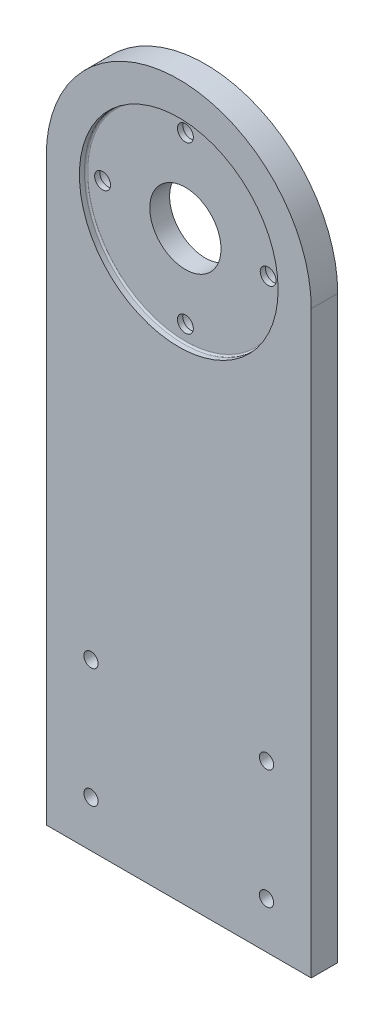
ISO-10303-21;
HEADER;
FILE_DESCRIPTION(('STEP AP214'),'2;1');
FILE_NAME('part.step','',(''),(''),'','','');
FILE_SCHEMA(('AUTOMOTIVE_DESIGN { 1 0 10303 214 1 1 1 1 }'));
ENDSEC;
DATA;
#1=APPLICATION_CONTEXT('core data for automotive mechanical design processes');
#2=APPLICATION_PROTOCOL_DEFINITION('international standard','automotive_design',2000,#1);
#3=PRODUCT_CONTEXT('',#1,'mechanical');
#4=PRODUCT('Part','Part','',(#3));
#5=PRODUCT_RELATED_PRODUCT_CATEGORY('part','',(#4));
#6=PRODUCT_DEFINITION_FORMATION('','',#4);
#7=PRODUCT_DEFINITION_CONTEXT('part definition',#1,'design');
#8=PRODUCT_DEFINITION('design','',#6,#7);
#9=PRODUCT_DEFINITION_SHAPE('','',#8);
#10=(LENGTH_UNIT() NAMED_UNIT(*) SI_UNIT(.MILLI.,.METRE.));
#11=(NAMED_UNIT(*) PLANE_ANGLE_UNIT() SI_UNIT($,.RADIAN.));
#12=(NAMED_UNIT(*) SI_UNIT($,.STERADIAN.) SOLID_ANGLE_UNIT());
#13=UNCERTAINTY_MEASURE_WITH_UNIT(LENGTH_MEASURE(1.E-05),#10,'distance_accuracy_value','');
#14=(GEOMETRIC_REPRESENTATION_CONTEXT(3) GLOBAL_UNCERTAINTY_ASSIGNED_CONTEXT((#13)) GLOBAL_UNIT_ASSIGNED_CONTEXT((#10,
#11,#12)) REPRESENTATION_CONTEXT('',''));
#15=CARTESIAN_POINT('',(0.,0.,0.));
#16=DIRECTION('',(0.,0.,1.));
#17=DIRECTION('',(1.,0.,0.));
#18=AXIS2_PLACEMENT_3D('',#15,#16,#17);
#19=CARTESIAN_POINT('',(-40.,175.,8.));
#20=DIRECTION('',(0.,0.,1.));
#21=DIRECTION('',(1.,0.,0.));
#22=AXIS2_PLACEMENT_3D('',#19,#20,#21);
#23=CYLINDRICAL_SURFACE('',#22,10.75);
#24=CARTESIAN_POINT('',(-40.,175.,0.));
#25=DIRECTION('',(0.,0.,1.));
#26=DIRECTION('',(1.,0.,0.));
#27=AXIS2_PLACEMENT_3D('',#24,#25,#26);
#28=CIRCLE('',#27,10.75);
#29=CARTESIAN_POINT('',(-29.25,175.,0.));
#30=VERTEX_POINT('',#29);
#31=EDGE_CURVE('E209',#30,#30,#28,.T.);
#32=ORIENTED_EDGE('',*,*,#31,.F.);
#33=EDGE_LOOP('',(#32));
#34=FACE_BOUND('',#33,.T.);
#35=CARTESIAN_POINT('',(-40.,175.,6.));
#36=DIRECTION('',(0.,0.,1.));
#37=DIRECTION('',(1.,0.,0.));
#38=AXIS2_PLACEMENT_3D('',#35,#36,#37);
#39=CIRCLE('',#38,10.75);
#40=CARTESIAN_POINT('',(-29.25,175.,6.));
#41=VERTEX_POINT('',#40);
#42=EDGE_CURVE('E248',#41,#41,#39,.F.);
#43=ORIENTED_EDGE('',*,*,#42,.F.);
#44=EDGE_LOOP('',(#43));
#45=FACE_BOUND('',#44,.T.);
#46=ADVANCED_FACE('F36',(#34,#45),#23,.F.);
#47=CARTESIAN_POINT('',(-65.0002210524578,175.000221056367,0.));
#48=DIRECTION('',(0.,0.,-1.));
#49=DIRECTION('',(-1.,0.,0.));
#50=AXIS2_PLACEMENT_3D('',#47,#48,#49);
#51=CYLINDRICAL_SURFACE('',#50,2.4);
#52=CARTESIAN_POINT('',(-65.0002210524578,175.000221056367,4.4));
#53=DIRECTION('',(0.,0.,-1.));
#54=DIRECTION('',(-1.,0.,0.));
#55=AXIS2_PLACEMENT_3D('',#52,#53,#54);
#56=CIRCLE('',#55,2.4);
#57=CARTESIAN_POINT('',(-67.4002210524578,175.000221056367,4.4));
#58=VERTEX_POINT('',#57);
#59=EDGE_CURVE('E212',#58,#58,#56,.T.);
#60=ORIENTED_EDGE('',*,*,#59,.T.);
#61=EDGE_LOOP('',(#60));
#62=FACE_BOUND('',#61,.T.);
#63=CARTESIAN_POINT('',(-65.0002210524578,175.000221056367,6.));
#64=DIRECTION('',(0.,0.,1.));
#65=DIRECTION('',(1.,0.,0.));
#66=AXIS2_PLACEMENT_3D('',#63,#64,#65);
#67=CIRCLE('',#66,2.4);
#68=CARTESIAN_POINT('',(-62.6002210524578,175.000221056367,6.));
#69=VERTEX_POINT('',#68);
#70=EDGE_CURVE('E251',#69,#69,#67,.F.);
#71=ORIENTED_EDGE('',*,*,#70,.F.);
#72=EDGE_LOOP('',(#71));
#73=FACE_BOUND('',#72,.T.);
#74=ADVANCED_FACE('F134',(#62,#73),#51,.F.);
#75=CARTESIAN_POINT('',(-40.0004421088247,150.000000003909,0.));
#76=DIRECTION('',(0.,0.,-1.));
#77=DIRECTION('',(-1.,0.,0.));
#78=AXIS2_PLACEMENT_3D('',#75,#76,#77);
#79=CYLINDRICAL_SURFACE('',#78,2.4);
#80=CARTESIAN_POINT('',(-40.0004421088247,150.000000003909,4.4));
#81=DIRECTION('',(0.,0.,-1.));
#82=DIRECTION('',(-1.,0.,0.));
#83=AXIS2_PLACEMENT_3D('',#80,#81,#82);
#84=CIRCLE('',#83,2.4);
#85=CARTESIAN_POINT('',(-42.4004421088247,150.000000003909,4.4));
#86=VERTEX_POINT('',#85);
#87=EDGE_CURVE('E221',#86,#86,#84,.T.);
#88=ORIENTED_EDGE('',*,*,#87,.T.);
#89=EDGE_LOOP('',(#88));
#90=FACE_BOUND('',#89,.T.);
#91=CARTESIAN_POINT('',(-40.0004421088247,150.000000003909,6.));
#92=DIRECTION('',(0.,0.,1.));
#93=DIRECTION('',(1.,0.,0.));
#94=AXIS2_PLACEMENT_3D('',#91,#92,#93);
#95=CIRCLE('',#94,2.4);
#96=CARTESIAN_POINT('',(-37.6004421088247,150.000000003909,6.));
#97=VERTEX_POINT('',#96);
#98=EDGE_CURVE('E254',#97,#97,#95,.F.);
#99=ORIENTED_EDGE('',*,*,#98,.F.);
#100=EDGE_LOOP('',(#99));
#101=FACE_BOUND('',#100,.T.);
#102=ADVANCED_FACE('F140',(#90,#101),#79,.F.);
#103=CARTESIAN_POINT('',(-15.000221056367,174.999778947542,0.));
#104=DIRECTION('',(0.,0.,-1.));
#105=DIRECTION('',(-1.,0.,0.));
#106=AXIS2_PLACEMENT_3D('',#103,#104,#105);
#107=CYLINDRICAL_SURFACE('',#106,2.4);
#108=CARTESIAN_POINT('',(-15.000221056367,174.999778947542,4.4));
#109=DIRECTION('',(0.,0.,-1.));
#110=DIRECTION('',(-1.,0.,0.));
#111=AXIS2_PLACEMENT_3D('',#108,#109,#110);
#112=CIRCLE('',#111,2.4);
#113=CARTESIAN_POINT('',(-17.400221056367,174.999778947542,4.4));
#114=VERTEX_POINT('',#113);
#115=EDGE_CURVE('E230',#114,#114,#112,.T.);
#116=ORIENTED_EDGE('',*,*,#115,.T.);
#117=EDGE_LOOP('',(#116));
#118=FACE_BOUND('',#117,.T.);
#119=CARTESIAN_POINT('',(-15.000221056367,174.999778947542,6.));
#120=DIRECTION('',(0.,0.,1.));
#121=DIRECTION('',(1.,0.,0.));
#122=AXIS2_PLACEMENT_3D('',#119,#120,#121);
#123=CIRCLE('',#122,2.4);
#124=CARTESIAN_POINT('',(-12.600221056367,174.999778947542,6.));
#125=VERTEX_POINT('',#124);
#126=EDGE_CURVE('E116',#125,#125,#123,.F.);
#127=ORIENTED_EDGE('',*,*,#126,.F.);
#128=EDGE_LOOP('',(#127));
#129=FACE_BOUND('',#128,.T.);
#130=ADVANCED_FACE('F278',(#118,#129),#107,.F.);
#131=CARTESIAN_POINT('',(-40.,200.,0.));
#132=DIRECTION('',(0.,0.,-1.));
#133=DIRECTION('',(-1.,0.,0.));
#134=AXIS2_PLACEMENT_3D('',#131,#132,#133);
#135=CYLINDRICAL_SURFACE('',#134,2.4);
#136=CARTESIAN_POINT('',(-40.,200.,4.4));
#137=DIRECTION('',(0.,0.,-1.));
#138=DIRECTION('',(-1.,0.,0.));
#139=AXIS2_PLACEMENT_3D('',#136,#137,#138);
#140=CIRCLE('',#139,2.4);
#141=CARTESIAN_POINT('',(-42.4,200.,4.4));
#142=VERTEX_POINT('',#141);
#143=EDGE_CURVE('E239',#142,#142,#140,.T.);
#144=ORIENTED_EDGE('',*,*,#143,.T.);
#145=EDGE_LOOP('',(#144));
#146=FACE_BOUND('',#145,.T.);
#147=CARTESIAN_POINT('',(-40.,200.,6.));
#148=DIRECTION('',(0.,0.,1.));
#149=DIRECTION('',(1.,0.,0.));
#150=AXIS2_PLACEMENT_3D('',#147,#148,#149);
#151=CIRCLE('',#150,2.4);
#152=CARTESIAN_POINT('',(-37.6,200.,6.));
#153=VERTEX_POINT('',#152);
#154=EDGE_CURVE('E114',#153,#153,#151,.F.);
#155=ORIENTED_EDGE('',*,*,#154,.F.);
#156=EDGE_LOOP('',(#155));
#157=FACE_BOUND('',#156,.T.);
#158=ADVANCED_FACE('F168',(#146,#157),#135,.F.);
#159=CARTESIAN_POINT('',(-40.,175.,8.));
#160=DIRECTION('',(0.,0.,1.));
#161=DIRECTION('',(1.,0.,0.));
#162=AXIS2_PLACEMENT_3D('',#159,#160,#161);
#163=PLANE('',#162);
#164=CARTESIAN_POINT('',(-40.,175.,8.));
#165=DIRECTION('',(0.,0.,1.));
#166=DIRECTION('',(1.,0.,0.));
#167=AXIS2_PLACEMENT_3D('',#164,#165,#166);
#168=CIRCLE('',#167,30.);
#169=CARTESIAN_POINT('',(-9.99999999999999,175.,8.));
#170=VERTEX_POINT('',#169);
#171=EDGE_CURVE('E117',#170,#170,#168,.T.);
#172=ORIENTED_EDGE('',*,*,#171,.F.);
#173=EDGE_LOOP('',(#172));
#174=FACE_BOUND('',#173,.T.);
#175=CARTESIAN_POINT('',(-66.5,14.,8.));
#176=DIRECTION('',(0.,0.,1.));
#177=DIRECTION('',(1.,0.,0.));
#178=AXIS2_PLACEMENT_3D('',#175,#176,#177);
#179=CIRCLE('',#178,2.15);
#180=CARTESIAN_POINT('',(-64.35,14.,8.));
#181=VERTEX_POINT('',#180);
#182=EDGE_CURVE('E206',#181,#181,#179,.T.);
#183=ORIENTED_EDGE('',*,*,#182,.F.);
#184=EDGE_LOOP('',(#183));
#185=FACE_BOUND('',#184,.T.);
#186=CARTESIAN_POINT('',(-13.5,14.,8.));
#187=DIRECTION('',(0.,0.,1.));
#188=DIRECTION('',(1.,0.,0.));
#189=AXIS2_PLACEMENT_3D('',#186,#187,#188);
#190=CIRCLE('',#189,2.15);
#191=CARTESIAN_POINT('',(-11.35,14.,8.));
#192=VERTEX_POINT('',#191);
#193=EDGE_CURVE('E200',#192,#192,#190,.T.);
#194=ORIENTED_EDGE('',*,*,#193,.F.);
#195=EDGE_LOOP('',(#194));
#196=FACE_BOUND('',#195,.T.);
#197=CARTESIAN_POINT('',(-13.5,50.,8.));
#198=DIRECTION('',(0.,0.,1.));
#199=DIRECTION('',(1.,0.,0.));
#200=AXIS2_PLACEMENT_3D('',#197,#198,#199);
#201=CIRCLE('',#200,2.15);
#202=CARTESIAN_POINT('',(-11.35,50.,8.));
#203=VERTEX_POINT('',#202);
#204=EDGE_CURVE('E194',#203,#203,#201,.T.);
#205=ORIENTED_EDGE('',*,*,#204,.F.);
#206=EDGE_LOOP('',(#205));
#207=FACE_BOUND('',#206,.T.);
#208=CARTESIAN_POINT('',(-66.5,50.,8.));
#209=DIRECTION('',(0.,0.,1.));
#210=DIRECTION('',(1.,0.,0.));
#211=AXIS2_PLACEMENT_3D('',#208,#209,#210);
#212=CIRCLE('',#211,2.15);
#213=CARTESIAN_POINT('',(-64.35,50.,8.));
#214=VERTEX_POINT('',#213);
#215=EDGE_CURVE('E188',#214,#214,#212,.T.);
#216=ORIENTED_EDGE('',*,*,#215,.F.);
#217=EDGE_LOOP('',(#216));
#218=FACE_BOUND('',#217,.T.);
#219=DIRECTION('',(0.,1.,0.));
#220=VECTOR('',#219,1.);
#221=CARTESIAN_POINT('',(0.,0.,8.));
#222=LINE('',#221,#220);
#223=CARTESIAN_POINT('',(0.,0.,8.));
#224=VERTEX_POINT('',#223);
#225=CARTESIAN_POINT('',(0.,175.,8.));
#226=VERTEX_POINT('',#225);
#227=EDGE_CURVE('E89',#224,#226,#222,.T.);
#228=ORIENTED_EDGE('',*,*,#227,.T.);
#229=CARTESIAN_POINT('',(-40.,175.,8.));
#230=DIRECTION('',(0.,0.,1.));
#231=DIRECTION('',(1.,0.,0.));
#232=AXIS2_PLACEMENT_3D('',#229,#230,#231);
#233=CIRCLE('',#232,40.);
#234=CARTESIAN_POINT('',(-80.,175.,8.));
#235=VERTEX_POINT('',#234);
#236=EDGE_CURVE('E84',#226,#235,#233,.T.);
#237=ORIENTED_EDGE('',*,*,#236,.T.);
#238=DIRECTION('',(0.,-1.,0.));
#239=VECTOR('',#238,1.);
#240=CARTESIAN_POINT('',(-80.,0.,8.));
#241=LINE('',#240,#239);
#242=CARTESIAN_POINT('',(-80.,0.,8.));
#243=VERTEX_POINT('',#242);
#244=EDGE_CURVE('E87',#235,#243,#241,.T.);
#245=ORIENTED_EDGE('',*,*,#244,.T.);
#246=DIRECTION('',(1.,0.,0.));
#247=VECTOR('',#246,1.);
#248=CARTESIAN_POINT('',(0.,0.,8.));
#249=LINE('',#248,#247);
#250=EDGE_CURVE('E53',#243,#224,#249,.T.);
#251=ORIENTED_EDGE('',*,*,#250,.T.);
#252=EDGE_LOOP('',(#228,#237,#245,#251));
#253=FACE_BOUND('',#252,.T.);
#254=ADVANCED_FACE('F85',(#174,#185,#196,#207,#218,#253),#163,.T.);
#255=CARTESIAN_POINT('',(-40.,175.,0.));
#256=DIRECTION('',(0.,0.,1.));
#257=DIRECTION('',(1.,0.,0.));
#258=AXIS2_PLACEMENT_3D('',#255,#256,#257);
#259=PLANE('',#258);
#260=CARTESIAN_POINT('',(-40.,200.,0.));
#261=DIRECTION('',(0.,0.,-1.));
#262=DIRECTION('',(-1.,0.,0.));
#263=AXIS2_PLACEMENT_3D('',#260,#261,#262);
#264=CIRCLE('',#263,4.);
#265=CARTESIAN_POINT('',(-44.,200.,0.));
#266=VERTEX_POINT('',#265);
#267=EDGE_CURVE('E245',#266,#266,#264,.T.);
#268=ORIENTED_EDGE('',*,*,#267,.F.);
#269=EDGE_LOOP('',(#268));
#270=FACE_BOUND('',#269,.T.);
#271=CARTESIAN_POINT('',(-15.000221056367,174.999778947542,0.));
#272=DIRECTION('',(0.,0.,-1.));
#273=DIRECTION('',(-1.,0.,0.));
#274=AXIS2_PLACEMENT_3D('',#271,#272,#273);
#275=CIRCLE('',#274,4.);
#276=CARTESIAN_POINT('',(-19.000221056367,174.999778947542,0.));
#277=VERTEX_POINT('',#276);
#278=EDGE_CURVE('E236',#277,#277,#275,.T.);
#279=ORIENTED_EDGE('',*,*,#278,.F.);
#280=EDGE_LOOP('',(#279));
#281=FACE_BOUND('',#280,.T.);
#282=CARTESIAN_POINT('',(-40.0004421088247,150.000000003909,0.));
#283=DIRECTION('',(0.,0.,-1.));
#284=DIRECTION('',(-1.,0.,0.));
#285=AXIS2_PLACEMENT_3D('',#282,#283,#284);
#286=CIRCLE('',#285,4.);
#287=CARTESIAN_POINT('',(-44.0004421088247,150.000000003909,0.));
#288=VERTEX_POINT('',#287);
#289=EDGE_CURVE('E227',#288,#288,#286,.T.);
#290=ORIENTED_EDGE('',*,*,#289,.F.);
#291=EDGE_LOOP('',(#290));
#292=FACE_BOUND('',#291,.T.);
#293=CARTESIAN_POINT('',(-65.0002210524578,175.000221056367,0.));
#294=DIRECTION('',(0.,0.,-1.));
#295=DIRECTION('',(-1.,0.,0.));
#296=AXIS2_PLACEMENT_3D('',#293,#294,#295);
#297=CIRCLE('',#296,4.);
#298=CARTESIAN_POINT('',(-69.0002210524578,175.000221056367,0.));
#299=VERTEX_POINT('',#298);
#300=EDGE_CURVE('E218',#299,#299,#297,.T.);
#301=ORIENTED_EDGE('',*,*,#300,.F.);
#302=EDGE_LOOP('',(#301));
#303=FACE_BOUND('',#302,.T.);
#304=ORIENTED_EDGE('',*,*,#31,.T.);
#305=EDGE_LOOP('',(#304));
#306=FACE_BOUND('',#305,.T.);
#307=CARTESIAN_POINT('',(-66.5,14.,0.));
#308=DIRECTION('',(0.,0.,1.));
#309=DIRECTION('',(1.,0.,0.));
#310=AXIS2_PLACEMENT_3D('',#307,#308,#309);
#311=CIRCLE('',#310,2.15);
#312=CARTESIAN_POINT('',(-64.35,14.,0.));
#313=VERTEX_POINT('',#312);
#314=EDGE_CURVE('E203',#313,#313,#311,.T.);
#315=ORIENTED_EDGE('',*,*,#314,.T.);
#316=EDGE_LOOP('',(#315));
#317=FACE_BOUND('',#316,.T.);
#318=CARTESIAN_POINT('',(-13.5,14.,0.));
#319=DIRECTION('',(0.,0.,1.));
#320=DIRECTION('',(1.,0.,0.));
#321=AXIS2_PLACEMENT_3D('',#318,#319,#320);
#322=CIRCLE('',#321,2.15);
#323=CARTESIAN_POINT('',(-11.35,14.,0.));
#324=VERTEX_POINT('',#323);
#325=EDGE_CURVE('E197',#324,#324,#322,.T.);
#326=ORIENTED_EDGE('',*,*,#325,.T.);
#327=EDGE_LOOP('',(#326));
#328=FACE_BOUND('',#327,.T.);
#329=CARTESIAN_POINT('',(-13.5,50.,0.));
#330=DIRECTION('',(0.,0.,1.));
#331=DIRECTION('',(1.,0.,0.));
#332=AXIS2_PLACEMENT_3D('',#329,#330,#331);
#333=CIRCLE('',#332,2.15);
#334=CARTESIAN_POINT('',(-11.35,50.,0.));
#335=VERTEX_POINT('',#334);
#336=EDGE_CURVE('E191',#335,#335,#333,.T.);
#337=ORIENTED_EDGE('',*,*,#336,.T.);
#338=EDGE_LOOP('',(#337));
#339=FACE_BOUND('',#338,.T.);
#340=CARTESIAN_POINT('',(-66.5,50.,0.));
#341=DIRECTION('',(0.,0.,1.));
#342=DIRECTION('',(1.,0.,0.));
#343=AXIS2_PLACEMENT_3D('',#340,#341,#342);
#344=CIRCLE('',#343,2.15);
#345=CARTESIAN_POINT('',(-64.35,50.,0.));
#346=VERTEX_POINT('',#345);
#347=EDGE_CURVE('E107',#346,#346,#344,.T.);
#348=ORIENTED_EDGE('',*,*,#347,.T.);
#349=EDGE_LOOP('',(#348));
#350=FACE_BOUND('',#349,.T.);
#351=DIRECTION('',(0.,1.,0.));
#352=VECTOR('',#351,1.);
#353=CARTESIAN_POINT('',(0.,0.,0.));
#354=LINE('',#353,#352);
#355=CARTESIAN_POINT('',(0.,0.,0.));
#356=VERTEX_POINT('',#355);
#357=CARTESIAN_POINT('',(0.,175.,0.));
#358=VERTEX_POINT('',#357);
#359=EDGE_CURVE('E104',#356,#358,#354,.T.);
#360=ORIENTED_EDGE('',*,*,#359,.F.);
#361=DIRECTION('',(1.,0.,0.));
#362=VECTOR('',#361,1.);
#363=CARTESIAN_POINT('',(0.,0.,0.));
#364=LINE('',#363,#362);
#365=CARTESIAN_POINT('',(-80.,0.,0.));
#366=VERTEX_POINT('',#365);
#367=EDGE_CURVE('E76',#366,#356,#364,.T.);
#368=ORIENTED_EDGE('',*,*,#367,.F.);
#369=DIRECTION('',(0.,-1.,0.));
#370=VECTOR('',#369,1.);
#371=CARTESIAN_POINT('',(-80.,0.,0.));
#372=LINE('',#371,#370);
#373=CARTESIAN_POINT('',(-80.,175.,0.));
#374=VERTEX_POINT('',#373);
#375=EDGE_CURVE('E70',#374,#366,#372,.T.);
#376=ORIENTED_EDGE('',*,*,#375,.F.);
#377=CARTESIAN_POINT('',(-40.,175.,0.));
#378=DIRECTION('',(0.,0.,1.));
#379=DIRECTION('',(1.,0.,0.));
#380=AXIS2_PLACEMENT_3D('',#377,#378,#379);
#381=CIRCLE('',#380,40.);
#382=EDGE_CURVE('E94',#358,#374,#381,.T.);
#383=ORIENTED_EDGE('',*,*,#382,.F.);
#384=EDGE_LOOP('',(#360,#368,#376,#383));
#385=FACE_BOUND('',#384,.T.);
#386=ADVANCED_FACE('F167',(#270,#281,#292,#303,#306,#317,#328,#339,#350,#385),#259,.F.);
#387=CARTESIAN_POINT('',(0.,0.,8.));
#388=DIRECTION('',(-1.,0.,0.));
#389=DIRECTION('',(0.,0.,1.));
#390=AXIS2_PLACEMENT_3D('',#387,#388,#389);
#391=PLANE('',#390);
#392=ORIENTED_EDGE('',*,*,#359,.T.);
#393=DIRECTION('',(0.,0.,-1.));
#394=VECTOR('',#393,1.);
#395=CARTESIAN_POINT('',(0.,175.,8.));
#396=LINE('',#395,#394);
#397=EDGE_CURVE('E95',#226,#358,#396,.T.);
#398=ORIENTED_EDGE('',*,*,#397,.F.);
#399=ORIENTED_EDGE('',*,*,#227,.F.);
#400=DIRECTION('',(0.,0.,-1.));
#401=VECTOR('',#400,1.);
#402=CARTESIAN_POINT('',(0.,0.,8.));
#403=LINE('',#402,#401);
#404=EDGE_CURVE('E100',#224,#356,#403,.T.);
#405=ORIENTED_EDGE('',*,*,#404,.T.);
#406=EDGE_LOOP('',(#392,#398,#399,#405));
#407=FACE_BOUND('',#406,.T.);
#408=ADVANCED_FACE('F172',(#407),#391,.F.);
#409=CARTESIAN_POINT('',(-40.,175.,8.));
#410=DIRECTION('',(0.,0.,-1.));
#411=DIRECTION('',(-1.,0.,0.));
#412=AXIS2_PLACEMENT_3D('',#409,#410,#411);
#413=CYLINDRICAL_SURFACE('',#412,40.);
#414=ORIENTED_EDGE('',*,*,#382,.T.);
#415=DIRECTION('',(0.,0.,-1.));
#416=VECTOR('',#415,1.);
#417=CARTESIAN_POINT('',(-80.,175.,8.));
#418=LINE('',#417,#416);
#419=EDGE_CURVE('E92',#235,#374,#418,.T.);
#420=ORIENTED_EDGE('',*,*,#419,.F.);
#421=ORIENTED_EDGE('',*,*,#236,.F.);
#422=ORIENTED_EDGE('',*,*,#397,.T.);
#423=EDGE_LOOP('',(#414,#420,#421,#422));
#424=FACE_BOUND('',#423,.T.);
#425=ADVANCED_FACE('F93',(#424),#413,.T.);
#426=CARTESIAN_POINT('',(-80.,0.,8.));
#427=DIRECTION('',(1.,0.,0.));
#428=DIRECTION('',(0.,0.,-1.));
#429=AXIS2_PLACEMENT_3D('',#426,#427,#428);
#430=PLANE('',#429);
#431=ORIENTED_EDGE('',*,*,#375,.T.);
#432=DIRECTION('',(0.,0.,-1.));
#433=VECTOR('',#432,1.);
#434=CARTESIAN_POINT('',(-80.,0.,8.));
#435=LINE('',#434,#433);
#436=EDGE_CURVE('E96',#243,#366,#435,.T.);
#437=ORIENTED_EDGE('',*,*,#436,.F.);
#438=ORIENTED_EDGE('',*,*,#244,.F.);
#439=ORIENTED_EDGE('',*,*,#419,.T.);
#440=EDGE_LOOP('',(#431,#437,#438,#439));
#441=FACE_BOUND('',#440,.T.);
#442=ADVANCED_FACE('F98',(#441),#430,.F.);
#443=CARTESIAN_POINT('',(0.,0.,8.));
#444=DIRECTION('',(0.,1.,0.));
#445=DIRECTION('',(0.,0.,1.));
#446=AXIS2_PLACEMENT_3D('',#443,#444,#445);
#447=PLANE('',#446);
#448=ORIENTED_EDGE('',*,*,#367,.T.);
#449=ORIENTED_EDGE('',*,*,#404,.F.);
#450=ORIENTED_EDGE('',*,*,#250,.F.);
#451=ORIENTED_EDGE('',*,*,#436,.T.);
#452=EDGE_LOOP('',(#448,#449,#450,#451));
#453=FACE_BOUND('',#452,.T.);
#454=ADVANCED_FACE('F163',(#453),#447,.F.);
#455=CARTESIAN_POINT('',(-66.5,50.,8.));
#456=DIRECTION('',(0.,0.,1.));
#457=DIRECTION('',(1.,0.,0.));
#458=AXIS2_PLACEMENT_3D('',#455,#456,#457);
#459=CYLINDRICAL_SURFACE('',#458,2.15);
#460=ORIENTED_EDGE('',*,*,#347,.F.);
#461=EDGE_LOOP('',(#460));
#462=FACE_BOUND('',#461,.T.);
#463=ORIENTED_EDGE('',*,*,#215,.T.);
#464=EDGE_LOOP('',(#463));
#465=FACE_BOUND('',#464,.T.);
#466=ADVANCED_FACE('F159',(#462,#465),#459,.F.);
#467=CARTESIAN_POINT('',(-13.5,50.,8.));
#468=DIRECTION('',(0.,0.,1.));
#469=DIRECTION('',(1.,0.,0.));
#470=AXIS2_PLACEMENT_3D('',#467,#468,#469);
#471=CYLINDRICAL_SURFACE('',#470,2.15);
#472=ORIENTED_EDGE('',*,*,#336,.F.);
#473=EDGE_LOOP('',(#472));
#474=FACE_BOUND('',#473,.T.);
#475=ORIENTED_EDGE('',*,*,#204,.T.);
#476=EDGE_LOOP('',(#475));
#477=FACE_BOUND('',#476,.T.);
#478=ADVANCED_FACE('F155',(#474,#477),#471,.F.);
#479=CARTESIAN_POINT('',(-13.5,14.,8.));
#480=DIRECTION('',(0.,0.,1.));
#481=DIRECTION('',(1.,0.,0.));
#482=AXIS2_PLACEMENT_3D('',#479,#480,#481);
#483=CYLINDRICAL_SURFACE('',#482,2.15);
#484=ORIENTED_EDGE('',*,*,#325,.F.);
#485=EDGE_LOOP('',(#484));
#486=FACE_BOUND('',#485,.T.);
#487=ORIENTED_EDGE('',*,*,#193,.T.);
#488=EDGE_LOOP('',(#487));
#489=FACE_BOUND('',#488,.T.);
#490=ADVANCED_FACE('F151',(#486,#489),#483,.F.);
#491=CARTESIAN_POINT('',(-66.5,14.,8.));
#492=DIRECTION('',(0.,0.,1.));
#493=DIRECTION('',(1.,0.,0.));
#494=AXIS2_PLACEMENT_3D('',#491,#492,#493);
#495=CYLINDRICAL_SURFACE('',#494,2.15);
#496=ORIENTED_EDGE('',*,*,#314,.F.);
#497=EDGE_LOOP('',(#496));
#498=FACE_BOUND('',#497,.T.);
#499=ORIENTED_EDGE('',*,*,#182,.T.);
#500=EDGE_LOOP('',(#499));
#501=FACE_BOUND('',#500,.T.);
#502=ADVANCED_FACE('F147',(#498,#501),#495,.F.);
#503=CARTESIAN_POINT('',(-62.6002210524578,175.000221056367,4.4));
#504=DIRECTION('',(0.,0.,1.));
#505=DIRECTION('',(1.,0.,0.));
#506=AXIS2_PLACEMENT_3D('',#503,#504,#505);
#507=PLANE('',#506);
#508=ORIENTED_EDGE('',*,*,#59,.F.);
#509=EDGE_LOOP('',(#508));
#510=FACE_BOUND('',#509,.T.);
#511=CARTESIAN_POINT('',(-65.0002210524578,175.000221056367,4.4));
#512=DIRECTION('',(0.,0.,-1.));
#513=DIRECTION('',(-1.,0.,0.));
#514=AXIS2_PLACEMENT_3D('',#511,#512,#513);
#515=CIRCLE('',#514,4.);
#516=CARTESIAN_POINT('',(-69.0002210524578,175.000221056367,4.4));
#517=VERTEX_POINT('',#516);
#518=EDGE_CURVE('E215',#517,#517,#515,.T.);
#519=ORIENTED_EDGE('',*,*,#518,.T.);
#520=EDGE_LOOP('',(#519));
#521=FACE_BOUND('',#520,.T.);
#522=ADVANCED_FACE('F150',(#510,#521),#507,.F.);
#523=CARTESIAN_POINT('',(-65.0002210524578,175.000221056367,0.));
#524=DIRECTION('',(0.,0.,-1.));
#525=DIRECTION('',(-1.,0.,0.));
#526=AXIS2_PLACEMENT_3D('',#523,#524,#525);
#527=CYLINDRICAL_SURFACE('',#526,4.);
#528=ORIENTED_EDGE('',*,*,#518,.F.);
#529=EDGE_LOOP('',(#528));
#530=FACE_BOUND('',#529,.T.);
#531=ORIENTED_EDGE('',*,*,#300,.T.);
#532=EDGE_LOOP('',(#531));
#533=FACE_BOUND('',#532,.T.);
#534=ADVANCED_FACE('F300',(#530,#533),#527,.F.);
#535=CARTESIAN_POINT('',(-37.6004421088247,150.000000003909,4.4));
#536=DIRECTION('',(0.,0.,1.));
#537=DIRECTION('',(1.,0.,0.));
#538=AXIS2_PLACEMENT_3D('',#535,#536,#537);
#539=PLANE('',#538);
#540=ORIENTED_EDGE('',*,*,#87,.F.);
#541=EDGE_LOOP('',(#540));
#542=FACE_BOUND('',#541,.T.);
#543=CARTESIAN_POINT('',(-40.0004421088247,150.000000003909,4.4));
#544=DIRECTION('',(0.,0.,-1.));
#545=DIRECTION('',(-1.,0.,0.));
#546=AXIS2_PLACEMENT_3D('',#543,#544,#545);
#547=CIRCLE('',#546,4.);
#548=CARTESIAN_POINT('',(-44.0004421088247,150.000000003909,4.4));
#549=VERTEX_POINT('',#548);
#550=EDGE_CURVE('E224',#549,#549,#547,.T.);
#551=ORIENTED_EDGE('',*,*,#550,.T.);
#552=EDGE_LOOP('',(#551));
#553=FACE_BOUND('',#552,.T.);
#554=ADVANCED_FACE('F297',(#542,#553),#539,.F.);
#555=CARTESIAN_POINT('',(-40.0004421088247,150.000000003909,0.));
#556=DIRECTION('',(0.,0.,-1.));
#557=DIRECTION('',(-1.,0.,0.));
#558=AXIS2_PLACEMENT_3D('',#555,#556,#557);
#559=CYLINDRICAL_SURFACE('',#558,4.);
#560=ORIENTED_EDGE('',*,*,#550,.F.);
#561=EDGE_LOOP('',(#560));
#562=FACE_BOUND('',#561,.T.);
#563=ORIENTED_EDGE('',*,*,#289,.T.);
#564=EDGE_LOOP('',(#563));
#565=FACE_BOUND('',#564,.T.);
#566=ADVANCED_FACE('F294',(#562,#565),#559,.F.);
#567=CARTESIAN_POINT('',(-12.600221056367,174.999778947542,4.4));
#568=DIRECTION('',(0.,0.,1.));
#569=DIRECTION('',(1.,0.,0.));
#570=AXIS2_PLACEMENT_3D('',#567,#568,#569);
#571=PLANE('',#570);
#572=ORIENTED_EDGE('',*,*,#115,.F.);
#573=EDGE_LOOP('',(#572));
#574=FACE_BOUND('',#573,.T.);
#575=CARTESIAN_POINT('',(-15.000221056367,174.999778947542,4.4));
#576=DIRECTION('',(0.,0.,-1.));
#577=DIRECTION('',(-1.,0.,0.));
#578=AXIS2_PLACEMENT_3D('',#575,#576,#577);
#579=CIRCLE('',#578,4.);
#580=CARTESIAN_POINT('',(-19.000221056367,174.999778947542,4.4));
#581=VERTEX_POINT('',#580);
#582=EDGE_CURVE('E233',#581,#581,#579,.T.);
#583=ORIENTED_EDGE('',*,*,#582,.T.);
#584=EDGE_LOOP('',(#583));
#585=FACE_BOUND('',#584,.T.);
#586=ADVANCED_FACE('F292',(#574,#585),#571,.F.);
#587=CARTESIAN_POINT('',(-15.000221056367,174.999778947542,0.));
#588=DIRECTION('',(0.,0.,-1.));
#589=DIRECTION('',(-1.,0.,0.));
#590=AXIS2_PLACEMENT_3D('',#587,#588,#589);
#591=CYLINDRICAL_SURFACE('',#590,4.);
#592=ORIENTED_EDGE('',*,*,#582,.F.);
#593=EDGE_LOOP('',(#592));
#594=FACE_BOUND('',#593,.T.);
#595=ORIENTED_EDGE('',*,*,#278,.T.);
#596=EDGE_LOOP('',(#595));
#597=FACE_BOUND('',#596,.T.);
#598=ADVANCED_FACE('F340',(#594,#597),#591,.F.);
#599=CARTESIAN_POINT('',(-37.6,200.,4.4));
#600=DIRECTION('',(0.,0.,1.));
#601=DIRECTION('',(1.,0.,0.));
#602=AXIS2_PLACEMENT_3D('',#599,#600,#601);
#603=PLANE('',#602);
#604=ORIENTED_EDGE('',*,*,#143,.F.);
#605=EDGE_LOOP('',(#604));
#606=FACE_BOUND('',#605,.T.);
#607=CARTESIAN_POINT('',(-40.,200.,4.4));
#608=DIRECTION('',(0.,0.,-1.));
#609=DIRECTION('',(-1.,0.,0.));
#610=AXIS2_PLACEMENT_3D('',#607,#608,#609);
#611=CIRCLE('',#610,4.);
#612=CARTESIAN_POINT('',(-44.,200.,4.4));
#613=VERTEX_POINT('',#612);
#614=EDGE_CURVE('E242',#613,#613,#611,.T.);
#615=ORIENTED_EDGE('',*,*,#614,.T.);
#616=EDGE_LOOP('',(#615));
#617=FACE_BOUND('',#616,.T.);
#618=ADVANCED_FACE('F335',(#606,#617),#603,.F.);
#619=CARTESIAN_POINT('',(-40.,200.,0.));
#620=DIRECTION('',(0.,0.,-1.));
#621=DIRECTION('',(-1.,0.,0.));
#622=AXIS2_PLACEMENT_3D('',#619,#620,#621);
#623=CYLINDRICAL_SURFACE('',#622,4.);
#624=ORIENTED_EDGE('',*,*,#614,.F.);
#625=EDGE_LOOP('',(#624));
#626=FACE_BOUND('',#625,.T.);
#627=ORIENTED_EDGE('',*,*,#267,.T.);
#628=EDGE_LOOP('',(#627));
#629=FACE_BOUND('',#628,.T.);
#630=ADVANCED_FACE('F329',(#626,#629),#623,.F.);
#631=CARTESIAN_POINT('',(-40.,175.,6.));
#632=DIRECTION('',(0.,0.,1.));
#633=DIRECTION('',(1.,0.,0.));
#634=AXIS2_PLACEMENT_3D('',#631,#632,#633);
#635=PLANE('',#634);
#636=CARTESIAN_POINT('',(-40.,175.,6.));
#637=DIRECTION('',(0.,0.,1.));
#638=DIRECTION('',(1.,0.,0.));
#639=AXIS2_PLACEMENT_3D('',#636,#637,#638);
#640=CIRCLE('',#639,29.5);
#641=CARTESIAN_POINT('',(-10.5,175.,6.));
#642=VERTEX_POINT('',#641);
#643=EDGE_CURVE('E45',#642,#642,#640,.T.);
#644=ORIENTED_EDGE('',*,*,#643,.T.);
#645=EDGE_LOOP('',(#644));
#646=FACE_BOUND('',#645,.T.);
#647=ORIENTED_EDGE('',*,*,#154,.T.);
#648=EDGE_LOOP('',(#647));
#649=FACE_BOUND('',#648,.T.);
#650=ORIENTED_EDGE('',*,*,#126,.T.);
#651=EDGE_LOOP('',(#650));
#652=FACE_BOUND('',#651,.T.);
#653=ORIENTED_EDGE('',*,*,#98,.T.);
#654=EDGE_LOOP('',(#653));
#655=FACE_BOUND('',#654,.T.);
#656=ORIENTED_EDGE('',*,*,#70,.T.);
#657=EDGE_LOOP('',(#656));
#658=FACE_BOUND('',#657,.T.);
#659=ORIENTED_EDGE('',*,*,#42,.T.);
#660=EDGE_LOOP('',(#659));
#661=FACE_BOUND('',#660,.T.);
#662=ADVANCED_FACE('F121',(#646,#649,#652,#655,#658,#661),#635,.T.);
#663=CARTESIAN_POINT('',(-40.,175.,6.));
#664=DIRECTION('',(0.,0.,1.));
#665=DIRECTION('',(1.,0.,0.));
#666=AXIS2_PLACEMENT_3D('',#663,#664,#665);
#667=CYLINDRICAL_SURFACE('',#666,30.);
#668=CARTESIAN_POINT('',(-40.,175.,6.5));
#669=DIRECTION('',(0.,0.,1.));
#670=DIRECTION('',(1.,0.,0.));
#671=AXIS2_PLACEMENT_3D('',#668,#669,#670);
#672=CIRCLE('',#671,30.);
#673=CARTESIAN_POINT('',(-9.99999999999999,175.,6.5));
#674=VERTEX_POINT('',#673);
#675=EDGE_CURVE('E11',#674,#674,#672,.F.);
#676=ORIENTED_EDGE('',*,*,#675,.T.);
#677=EDGE_LOOP('',(#676));
#678=FACE_BOUND('',#677,.T.);
#679=ORIENTED_EDGE('',*,*,#171,.T.);
#680=EDGE_LOOP('',(#679));
#681=FACE_BOUND('',#680,.T.);
#682=ADVANCED_FACE('F125',(#678,#681),#667,.F.);
#683=CARTESIAN_POINT('',(-40.,175.,6.5));
#684=DIRECTION('',(0.,0.,1.));
#685=DIRECTION('',(1.,0.,0.));
#686=AXIS2_PLACEMENT_3D('',#683,#684,#685);
#687=TOROIDAL_SURFACE('',#686,29.5,0.5);
#688=ORIENTED_EDGE('',*,*,#675,.F.);
#689=EDGE_LOOP('',(#688));
#690=FACE_BOUND('',#689,.T.);
#691=ORIENTED_EDGE('',*,*,#643,.F.);
#692=EDGE_LOOP('',(#691));
#693=FACE_BOUND('',#692,.T.);
#694=ADVANCED_FACE('F38',(#690,#693),#687,.F.);
#695=CLOSED_SHELL('',(#46,#74,#102,#130,#158,#254,#386,#408,#425,#442,#454,#466,#478,#490,#502,
#522,#534,#554,#566,#586,#598,#618,#630,#662,#682,#694));
#696=MANIFOLD_SOLID_BREP('B2',#695);
#697=ADVANCED_BREP_SHAPE_REPRESENTATION('',(#18,#696),#14);
#698=SHAPE_DEFINITION_REPRESENTATION(#9,#697);
ENDSEC;
END-ISO-10303-21;
